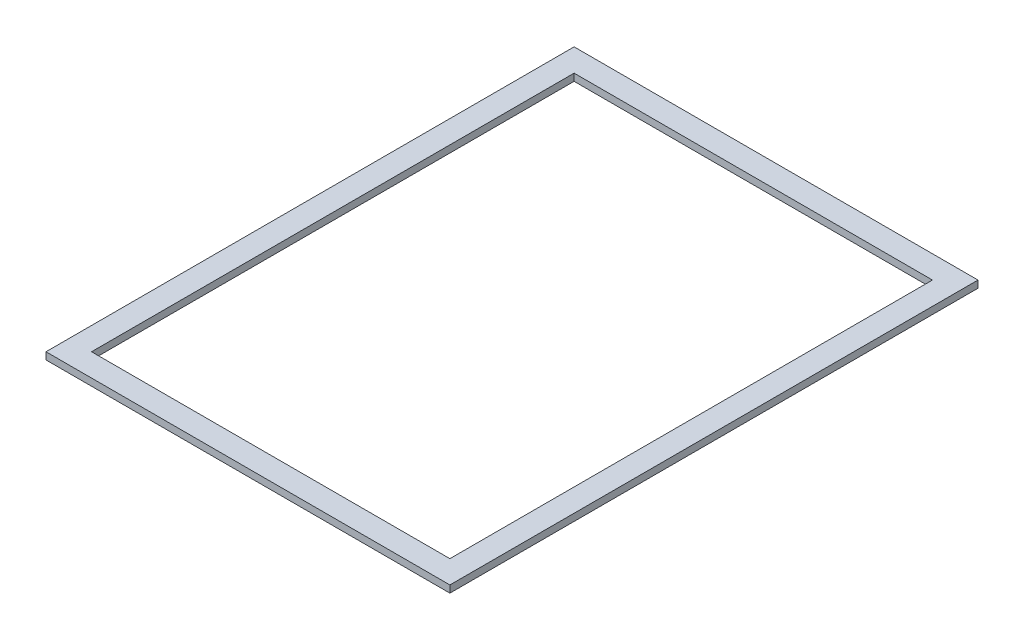
ISO-10303-21;
HEADER;
FILE_DESCRIPTION(('STEP AP214'),'2;1');
FILE_NAME('part.step','',(''),(''),'','','');
FILE_SCHEMA(('AUTOMOTIVE_DESIGN { 1 0 10303 214 1 1 1 1 }'));
ENDSEC;
DATA;
#1=APPLICATION_CONTEXT('core data for automotive mechanical design processes');
#2=APPLICATION_PROTOCOL_DEFINITION('international standard','automotive_design',2000,#1);
#3=PRODUCT_CONTEXT('',#1,'mechanical');
#4=PRODUCT('Part','Part','',(#3));
#5=PRODUCT_RELATED_PRODUCT_CATEGORY('part','',(#4));
#6=PRODUCT_DEFINITION_FORMATION('','',#4);
#7=PRODUCT_DEFINITION_CONTEXT('part definition',#1,'design');
#8=PRODUCT_DEFINITION('design','',#6,#7);
#9=PRODUCT_DEFINITION_SHAPE('','',#8);
#10=(LENGTH_UNIT() NAMED_UNIT(*) SI_UNIT(.MILLI.,.METRE.));
#11=(NAMED_UNIT(*) PLANE_ANGLE_UNIT() SI_UNIT($,.RADIAN.));
#12=(NAMED_UNIT(*) SI_UNIT($,.STERADIAN.) SOLID_ANGLE_UNIT());
#13=UNCERTAINTY_MEASURE_WITH_UNIT(LENGTH_MEASURE(1.E-05),#10,'distance_accuracy_value','');
#14=(GEOMETRIC_REPRESENTATION_CONTEXT(3) GLOBAL_UNCERTAINTY_ASSIGNED_CONTEXT((#13)) GLOBAL_UNIT_ASSIGNED_CONTEXT((#10,
#11,#12)) REPRESENTATION_CONTEXT('',''));
#15=CARTESIAN_POINT('',(0.,0.,0.));
#16=DIRECTION('',(0.,0.,1.));
#17=DIRECTION('',(1.,0.,0.));
#18=AXIS2_PLACEMENT_3D('',#15,#16,#17);
#19=CARTESIAN_POINT('',(0.,130.6195,0.));
#20=DIRECTION('',(0.,1.,0.));
#21=DIRECTION('',(0.,0.,1.));
#22=AXIS2_PLACEMENT_3D('',#19,#20,#21);
#23=PLANE('',#22);
#24=DIRECTION('',(0.,0.,1.));
#25=VECTOR('',#24,1.);
#26=CARTESIAN_POINT('',(0.,130.6195,-117.828));
#27=LINE('',#26,#25);
#28=CARTESIAN_POINT('',(0.,130.6195,-117.828));
#29=VERTEX_POINT('',#28);
#30=CARTESIAN_POINT('',(0.,130.6195,0.));
#31=VERTEX_POINT('',#30);
#32=EDGE_CURVE('E134',#29,#31,#27,.T.);
#33=ORIENTED_EDGE('',*,*,#32,.T.);
#34=DIRECTION('',(1.,0.,0.));
#35=VECTOR('',#34,1.);
#36=CARTESIAN_POINT('',(0.,130.6195,0.));
#37=LINE('',#36,#35);
#38=CARTESIAN_POINT('',(90.114,130.6195,0.));
#39=VERTEX_POINT('',#38);
#40=EDGE_CURVE('E137',#31,#39,#37,.T.);
#41=ORIENTED_EDGE('',*,*,#40,.T.);
#42=DIRECTION('',(0.,0.,-1.));
#43=VECTOR('',#42,1.);
#44=CARTESIAN_POINT('',(90.114,130.6195,-117.828));
#45=LINE('',#44,#43);
#46=CARTESIAN_POINT('',(90.114,130.6195,-117.828));
#47=VERTEX_POINT('',#46);
#48=EDGE_CURVE('E140',#39,#47,#45,.T.);
#49=ORIENTED_EDGE('',*,*,#48,.T.);
#50=DIRECTION('',(-1.,0.,0.));
#51=VECTOR('',#50,1.);
#52=CARTESIAN_POINT('',(0.,130.6195,-117.828));
#53=LINE('',#52,#51);
#54=EDGE_CURVE('E142',#47,#29,#53,.T.);
#55=ORIENTED_EDGE('',*,*,#54,.T.);
#56=EDGE_LOOP('',(#33,#41,#49,#55));
#57=FACE_BOUND('',#56,.T.);
#58=DIRECTION('',(0.,0.,1.));
#59=VECTOR('',#58,1.);
#60=CARTESIAN_POINT('',(5.08,130.6195,-112.748));
#61=LINE('',#60,#59);
#62=CARTESIAN_POINT('',(5.08,130.6195,-112.748));
#63=VERTEX_POINT('',#62);
#64=CARTESIAN_POINT('',(5.08,130.6195,-5.08));
#65=VERTEX_POINT('',#64);
#66=EDGE_CURVE('E106',#63,#65,#61,.T.);
#67=ORIENTED_EDGE('',*,*,#66,.F.);
#68=DIRECTION('',(-1.,0.,0.));
#69=VECTOR('',#68,1.);
#70=CARTESIAN_POINT('',(5.08,130.6195,-112.748));
#71=LINE('',#70,#69);
#72=CARTESIAN_POINT('',(85.034,130.6195,-112.748));
#73=VERTEX_POINT('',#72);
#74=EDGE_CURVE('E98',#73,#63,#71,.T.);
#75=ORIENTED_EDGE('',*,*,#74,.F.);
#76=DIRECTION('',(0.,0.,-1.));
#77=VECTOR('',#76,1.);
#78=CARTESIAN_POINT('',(85.034,130.6195,-112.748));
#79=LINE('',#78,#77);
#80=CARTESIAN_POINT('',(85.034,130.6195,-5.08));
#81=VERTEX_POINT('',#80);
#82=EDGE_CURVE('E120',#81,#73,#79,.T.);
#83=ORIENTED_EDGE('',*,*,#82,.F.);
#84=DIRECTION('',(1.,0.,0.));
#85=VECTOR('',#84,1.);
#86=CARTESIAN_POINT('',(5.08,130.6195,-5.08));
#87=LINE('',#86,#85);
#88=EDGE_CURVE('E118',#65,#81,#87,.T.);
#89=ORIENTED_EDGE('',*,*,#88,.F.);
#90=EDGE_LOOP('',(#67,#75,#83,#89));
#91=FACE_BOUND('',#90,.T.);
#92=ADVANCED_FACE('F33',(#57,#91),#23,.T.);
#93=CARTESIAN_POINT('',(0.,129.032,0.));
#94=DIRECTION('',(0.,1.,0.));
#95=DIRECTION('',(0.,0.,1.));
#96=AXIS2_PLACEMENT_3D('',#93,#94,#95);
#97=PLANE('',#96);
#98=DIRECTION('',(0.,0.,1.));
#99=VECTOR('',#98,1.);
#100=CARTESIAN_POINT('',(0.,129.032,-117.828));
#101=LINE('',#100,#99);
#102=CARTESIAN_POINT('',(0.,129.032,-117.828));
#103=VERTEX_POINT('',#102);
#104=CARTESIAN_POINT('',(0.,129.032,0.));
#105=VERTEX_POINT('',#104);
#106=EDGE_CURVE('E114',#103,#105,#101,.T.);
#107=ORIENTED_EDGE('',*,*,#106,.F.);
#108=DIRECTION('',(-1.,0.,0.));
#109=VECTOR('',#108,1.);
#110=CARTESIAN_POINT('',(0.,129.032,-117.828));
#111=LINE('',#110,#109);
#112=CARTESIAN_POINT('',(90.114,129.032,-117.828));
#113=VERTEX_POINT('',#112);
#114=EDGE_CURVE('E138',#113,#103,#111,.T.);
#115=ORIENTED_EDGE('',*,*,#114,.F.);
#116=DIRECTION('',(0.,0.,-1.));
#117=VECTOR('',#116,1.);
#118=CARTESIAN_POINT('',(90.114,129.032,-117.828));
#119=LINE('',#118,#117);
#120=CARTESIAN_POINT('',(90.114,129.032,0.));
#121=VERTEX_POINT('',#120);
#122=EDGE_CURVE('E149',#121,#113,#119,.T.);
#123=ORIENTED_EDGE('',*,*,#122,.F.);
#124=DIRECTION('',(1.,0.,0.));
#125=VECTOR('',#124,1.);
#126=CARTESIAN_POINT('',(0.,129.032,0.));
#127=LINE('',#126,#125);
#128=EDGE_CURVE('E147',#105,#121,#127,.T.);
#129=ORIENTED_EDGE('',*,*,#128,.F.);
#130=EDGE_LOOP('',(#107,#115,#123,#129));
#131=FACE_BOUND('',#130,.T.);
#132=DIRECTION('',(-1.,0.,0.));
#133=VECTOR('',#132,1.);
#134=CARTESIAN_POINT('',(5.08,129.032,-112.748));
#135=LINE('',#134,#133);
#136=CARTESIAN_POINT('',(85.034,129.032,-112.748));
#137=VERTEX_POINT('',#136);
#138=CARTESIAN_POINT('',(5.08,129.032,-112.748));
#139=VERTEX_POINT('',#138);
#140=EDGE_CURVE('E56',#137,#139,#135,.T.);
#141=ORIENTED_EDGE('',*,*,#140,.T.);
#142=DIRECTION('',(0.,0.,1.));
#143=VECTOR('',#142,1.);
#144=CARTESIAN_POINT('',(5.08,129.032,-112.748));
#145=LINE('',#144,#143);
#146=CARTESIAN_POINT('',(5.08,129.032,-5.08));
#147=VERTEX_POINT('',#146);
#148=EDGE_CURVE('E113',#139,#147,#145,.T.);
#149=ORIENTED_EDGE('',*,*,#148,.T.);
#150=DIRECTION('',(1.,0.,0.));
#151=VECTOR('',#150,1.);
#152=CARTESIAN_POINT('',(5.08,129.032,-5.08));
#153=LINE('',#152,#151);
#154=CARTESIAN_POINT('',(85.034,129.032,-5.08));
#155=VERTEX_POINT('',#154);
#156=EDGE_CURVE('E126',#147,#155,#153,.T.);
#157=ORIENTED_EDGE('',*,*,#156,.T.);
#158=DIRECTION('',(0.,0.,-1.));
#159=VECTOR('',#158,1.);
#160=CARTESIAN_POINT('',(85.034,129.032,-112.748));
#161=LINE('',#160,#159);
#162=EDGE_CURVE('E107',#155,#137,#161,.T.);
#163=ORIENTED_EDGE('',*,*,#162,.T.);
#164=EDGE_LOOP('',(#141,#149,#157,#163));
#165=FACE_BOUND('',#164,.T.);
#166=ADVANCED_FACE('F167',(#131,#165),#97,.F.);
#167=CARTESIAN_POINT('',(0.,130.6195,-117.828));
#168=DIRECTION('',(1.,0.,0.));
#169=DIRECTION('',(0.,0.,-1.));
#170=AXIS2_PLACEMENT_3D('',#167,#168,#169);
#171=PLANE('',#170);
#172=ORIENTED_EDGE('',*,*,#106,.T.);
#173=DIRECTION('',(0.,-1.,0.));
#174=VECTOR('',#173,1.);
#175=CARTESIAN_POINT('',(0.,130.6195,0.));
#176=LINE('',#175,#174);
#177=EDGE_CURVE('E11',#31,#105,#176,.T.);
#178=ORIENTED_EDGE('',*,*,#177,.F.);
#179=ORIENTED_EDGE('',*,*,#32,.F.);
#180=DIRECTION('',(0.,-1.,0.));
#181=VECTOR('',#180,1.);
#182=CARTESIAN_POINT('',(0.,130.6195,-117.828));
#183=LINE('',#182,#181);
#184=EDGE_CURVE('E144',#29,#103,#183,.T.);
#185=ORIENTED_EDGE('',*,*,#184,.T.);
#186=EDGE_LOOP('',(#172,#178,#179,#185));
#187=FACE_BOUND('',#186,.T.);
#188=ADVANCED_FACE('F35',(#187),#171,.F.);
#189=CARTESIAN_POINT('',(0.,130.6195,0.));
#190=DIRECTION('',(0.,0.,-1.));
#191=DIRECTION('',(-1.,0.,0.));
#192=AXIS2_PLACEMENT_3D('',#189,#190,#191);
#193=PLANE('',#192);
#194=ORIENTED_EDGE('',*,*,#128,.T.);
#195=DIRECTION('',(0.,-1.,0.));
#196=VECTOR('',#195,1.);
#197=CARTESIAN_POINT('',(90.114,130.6195,0.));
#198=LINE('',#197,#196);
#199=EDGE_CURVE('E41',#39,#121,#198,.T.);
#200=ORIENTED_EDGE('',*,*,#199,.F.);
#201=ORIENTED_EDGE('',*,*,#40,.F.);
#202=ORIENTED_EDGE('',*,*,#177,.T.);
#203=EDGE_LOOP('',(#194,#200,#201,#202));
#204=FACE_BOUND('',#203,.T.);
#205=ADVANCED_FACE('F177',(#204),#193,.F.);
#206=CARTESIAN_POINT('',(90.114,130.6195,-117.828));
#207=DIRECTION('',(-1.,0.,0.));
#208=DIRECTION('',(0.,0.,1.));
#209=AXIS2_PLACEMENT_3D('',#206,#207,#208);
#210=PLANE('',#209);
#211=ORIENTED_EDGE('',*,*,#122,.T.);
#212=DIRECTION('',(0.,-1.,0.));
#213=VECTOR('',#212,1.);
#214=CARTESIAN_POINT('',(90.114,130.6195,-117.828));
#215=LINE('',#214,#213);
#216=EDGE_CURVE('E154',#47,#113,#215,.T.);
#217=ORIENTED_EDGE('',*,*,#216,.F.);
#218=ORIENTED_EDGE('',*,*,#48,.F.);
#219=ORIENTED_EDGE('',*,*,#199,.T.);
#220=EDGE_LOOP('',(#211,#217,#218,#219));
#221=FACE_BOUND('',#220,.T.);
#222=ADVANCED_FACE('F161',(#221),#210,.F.);
#223=CARTESIAN_POINT('',(0.,130.6195,-117.828));
#224=DIRECTION('',(0.,0.,1.));
#225=DIRECTION('',(1.,0.,0.));
#226=AXIS2_PLACEMENT_3D('',#223,#224,#225);
#227=PLANE('',#226);
#228=ORIENTED_EDGE('',*,*,#114,.T.);
#229=ORIENTED_EDGE('',*,*,#184,.F.);
#230=ORIENTED_EDGE('',*,*,#54,.F.);
#231=ORIENTED_EDGE('',*,*,#216,.T.);
#232=EDGE_LOOP('',(#228,#229,#230,#231));
#233=FACE_BOUND('',#232,.T.);
#234=ADVANCED_FACE('F171',(#233),#227,.F.);
#235=CARTESIAN_POINT('',(5.08,130.6195,-112.748));
#236=DIRECTION('',(0.,0.,1.));
#237=DIRECTION('',(1.,0.,0.));
#238=AXIS2_PLACEMENT_3D('',#235,#236,#237);
#239=PLANE('',#238);
#240=ORIENTED_EDGE('',*,*,#140,.F.);
#241=DIRECTION('',(0.,-1.,0.));
#242=VECTOR('',#241,1.);
#243=CARTESIAN_POINT('',(85.034,130.6195,-112.748));
#244=LINE('',#243,#242);
#245=EDGE_CURVE('E102',#73,#137,#244,.T.);
#246=ORIENTED_EDGE('',*,*,#245,.F.);
#247=ORIENTED_EDGE('',*,*,#74,.T.);
#248=DIRECTION('',(0.,-1.,0.));
#249=VECTOR('',#248,1.);
#250=CARTESIAN_POINT('',(5.08,130.6195,-112.748));
#251=LINE('',#250,#249);
#252=EDGE_CURVE('E101',#63,#139,#251,.T.);
#253=ORIENTED_EDGE('',*,*,#252,.T.);
#254=EDGE_LOOP('',(#240,#246,#247,#253));
#255=FACE_BOUND('',#254,.T.);
#256=ADVANCED_FACE('F100',(#255),#239,.T.);
#257=CARTESIAN_POINT('',(5.08,130.6195,-112.748));
#258=DIRECTION('',(1.,0.,0.));
#259=DIRECTION('',(0.,0.,-1.));
#260=AXIS2_PLACEMENT_3D('',#257,#258,#259);
#261=PLANE('',#260);
#262=ORIENTED_EDGE('',*,*,#148,.F.);
#263=ORIENTED_EDGE('',*,*,#252,.F.);
#264=ORIENTED_EDGE('',*,*,#66,.T.);
#265=DIRECTION('',(0.,-1.,0.));
#266=VECTOR('',#265,1.);
#267=CARTESIAN_POINT('',(5.08,130.6195,-5.08));
#268=LINE('',#267,#266);
#269=EDGE_CURVE('E115',#65,#147,#268,.T.);
#270=ORIENTED_EDGE('',*,*,#269,.T.);
#271=EDGE_LOOP('',(#262,#263,#264,#270));
#272=FACE_BOUND('',#271,.T.);
#273=ADVANCED_FACE('F110',(#272),#261,.T.);
#274=CARTESIAN_POINT('',(5.08,130.6195,-5.08));
#275=DIRECTION('',(0.,0.,-1.));
#276=DIRECTION('',(-1.,0.,0.));
#277=AXIS2_PLACEMENT_3D('',#274,#275,#276);
#278=PLANE('',#277);
#279=ORIENTED_EDGE('',*,*,#156,.F.);
#280=ORIENTED_EDGE('',*,*,#269,.F.);
#281=ORIENTED_EDGE('',*,*,#88,.T.);
#282=DIRECTION('',(0.,-1.,0.));
#283=VECTOR('',#282,1.);
#284=CARTESIAN_POINT('',(85.034,130.6195,-5.08));
#285=LINE('',#284,#283);
#286=EDGE_CURVE('E48',#81,#155,#285,.T.);
#287=ORIENTED_EDGE('',*,*,#286,.T.);
#288=EDGE_LOOP('',(#279,#280,#281,#287));
#289=FACE_BOUND('',#288,.T.);
#290=ADVANCED_FACE('F200',(#289),#278,.T.);
#291=CARTESIAN_POINT('',(85.034,130.6195,-112.748));
#292=DIRECTION('',(-1.,0.,0.));
#293=DIRECTION('',(0.,0.,1.));
#294=AXIS2_PLACEMENT_3D('',#291,#292,#293);
#295=PLANE('',#294);
#296=ORIENTED_EDGE('',*,*,#162,.F.);
#297=ORIENTED_EDGE('',*,*,#286,.F.);
#298=ORIENTED_EDGE('',*,*,#82,.T.);
#299=ORIENTED_EDGE('',*,*,#245,.T.);
#300=EDGE_LOOP('',(#296,#297,#298,#299));
#301=FACE_BOUND('',#300,.T.);
#302=ADVANCED_FACE('F204',(#301),#295,.T.);
#303=CLOSED_SHELL('',(#92,#166,#188,#205,#222,#234,#256,#273,#290,#302));
#304=MANIFOLD_SOLID_BREP('B2',#303);
#305=ADVANCED_BREP_SHAPE_REPRESENTATION('',(#18,#304),#14);
#306=SHAPE_DEFINITION_REPRESENTATION(#9,#305);
ENDSEC;
END-ISO-10303-21;
